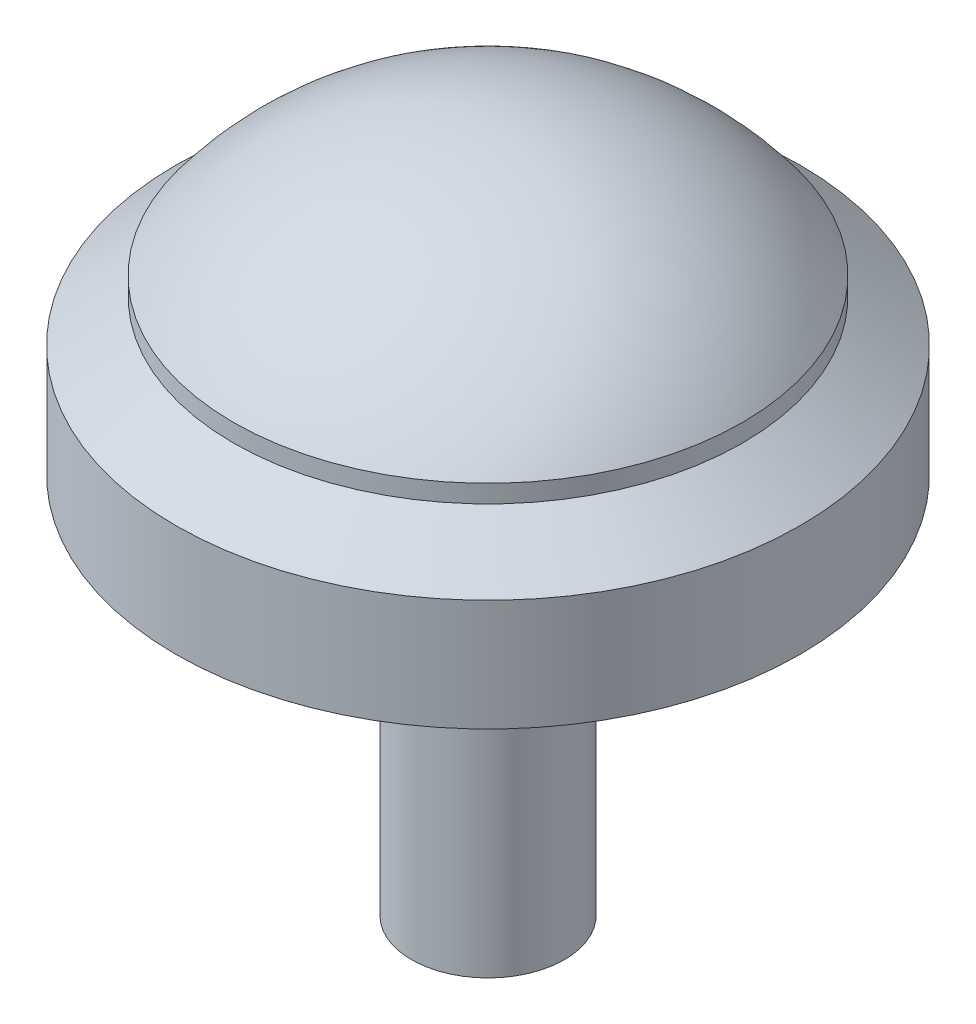
ISO-10303-21;
HEADER;
FILE_DESCRIPTION(('STEP AP214'),'2;1');
FILE_NAME('part.step','',(''),(''),'','','');
FILE_SCHEMA(('AUTOMOTIVE_DESIGN { 1 0 10303 214 1 1 1 1 }'));
ENDSEC;
DATA;
#1=APPLICATION_CONTEXT('core data for automotive mechanical design processes');
#2=APPLICATION_PROTOCOL_DEFINITION('international standard','automotive_design',2000,#1);
#3=PRODUCT_CONTEXT('',#1,'mechanical');
#4=PRODUCT('Part','Part','',(#3));
#5=PRODUCT_RELATED_PRODUCT_CATEGORY('part','',(#4));
#6=PRODUCT_DEFINITION_FORMATION('','',#4);
#7=PRODUCT_DEFINITION_CONTEXT('part definition',#1,'design');
#8=PRODUCT_DEFINITION('design','',#6,#7);
#9=PRODUCT_DEFINITION_SHAPE('','',#8);
#10=(LENGTH_UNIT() NAMED_UNIT(*) SI_UNIT(.MILLI.,.METRE.));
#11=(NAMED_UNIT(*) PLANE_ANGLE_UNIT() SI_UNIT($,.RADIAN.));
#12=(NAMED_UNIT(*) SI_UNIT($,.STERADIAN.) SOLID_ANGLE_UNIT());
#13=UNCERTAINTY_MEASURE_WITH_UNIT(LENGTH_MEASURE(1.E-05),#10,'distance_accuracy_value','');
#14=(GEOMETRIC_REPRESENTATION_CONTEXT(3) GLOBAL_UNCERTAINTY_ASSIGNED_CONTEXT((#13)) GLOBAL_UNIT_ASSIGNED_CONTEXT((#10,
#11,#12)) REPRESENTATION_CONTEXT('',''));
#15=CARTESIAN_POINT('',(0.,0.,0.));
#16=DIRECTION('',(0.,0.,1.));
#17=DIRECTION('',(1.,0.,0.));
#18=AXIS2_PLACEMENT_3D('',#15,#16,#17);
#19=CARTESIAN_POINT('',(0.,25.5,0.));
#20=DIRECTION('',(0.,-1.,0.));
#21=DIRECTION('',(0.,0.,-1.));
#22=AXIS2_PLACEMENT_3D('',#19,#20,#21);
#23=CYLINDRICAL_SURFACE('',#22,49.);
#24=CARTESIAN_POINT('',(0.,17.4999999999999,0.));
#25=DIRECTION('',(0.,1.,0.));
#26=DIRECTION('',(0.,0.,1.));
#27=AXIS2_PLACEMENT_3D('',#24,#25,#26);
#28=CIRCLE('',#27,49.);
#29=CARTESIAN_POINT('',(0.,17.4999999999999,49.));
#30=VERTEX_POINT('',#29);
#31=EDGE_CURVE('E62',#30,#30,#28,.F.);
#32=ORIENTED_EDGE('',*,*,#31,.T.);
#33=EDGE_LOOP('',(#32));
#34=FACE_BOUND('',#33,.T.);
#35=CARTESIAN_POINT('',(0.,0.,0.));
#36=DIRECTION('',(0.,1.,0.));
#37=DIRECTION('',(0.,0.,1.));
#38=AXIS2_PLACEMENT_3D('',#35,#36,#37);
#39=CIRCLE('',#38,49.);
#40=CARTESIAN_POINT('',(0.,0.,49.));
#41=VERTEX_POINT('',#40);
#42=EDGE_CURVE('E66',#41,#41,#39,.T.);
#43=ORIENTED_EDGE('',*,*,#42,.T.);
#44=EDGE_LOOP('',(#43));
#45=FACE_BOUND('',#44,.T.);
#46=ADVANCED_FACE('F47',(#34,#45),#23,.T.);
#47=CARTESIAN_POINT('',(0.,0.,0.));
#48=DIRECTION('',(0.,1.,0.));
#49=DIRECTION('',(0.,0.,1.));
#50=AXIS2_PLACEMENT_3D('',#47,#48,#49);
#51=PLANE('',#50);
#52=CARTESIAN_POINT('',(0.,0.,0.));
#53=DIRECTION('',(0.,-1.,0.));
#54=DIRECTION('',(0.,0.,-1.));
#55=AXIS2_PLACEMENT_3D('',#52,#53,#54);
#56=CIRCLE('',#55,12.);
#57=CARTESIAN_POINT('',(0.,0.,-12.));
#58=VERTEX_POINT('',#57);
#59=EDGE_CURVE('E11',#58,#58,#56,.T.);
#60=ORIENTED_EDGE('',*,*,#59,.F.);
#61=EDGE_LOOP('',(#60));
#62=FACE_BOUND('',#61,.T.);
#63=ORIENTED_EDGE('',*,*,#42,.F.);
#64=EDGE_LOOP('',(#63));
#65=FACE_BOUND('',#64,.T.);
#66=ADVANCED_FACE('F88',(#62,#65),#51,.F.);
#67=CARTESIAN_POINT('',(0.,27.,0.));
#68=DIRECTION('',(0.,-1.,0.));
#69=DIRECTION('',(0.,0.,-1.));
#70=AXIS2_PLACEMENT_3D('',#67,#68,#69);
#71=CYLINDRICAL_SURFACE('',#70,39.95);
#72=CARTESIAN_POINT('',(0.,24.1966477290077,0.));
#73=DIRECTION('',(0.,-1.,0.));
#74=DIRECTION('',(0.,0.,-1.));
#75=AXIS2_PLACEMENT_3D('',#72,#73,#74);
#76=CIRCLE('',#75,39.95);
#77=CARTESIAN_POINT('',(0.,24.1966477290077,-39.95));
#78=VERTEX_POINT('',#77);
#79=EDGE_CURVE('E52',#78,#78,#76,.F.);
#80=ORIENTED_EDGE('',*,*,#79,.T.);
#81=EDGE_LOOP('',(#80));
#82=FACE_BOUND('',#81,.T.);
#83=CARTESIAN_POINT('',(0.,27.,0.));
#84=DIRECTION('',(0.,1.,0.));
#85=DIRECTION('',(0.,0.,1.));
#86=AXIS2_PLACEMENT_3D('',#83,#84,#85);
#87=CIRCLE('',#86,39.95);
#88=CARTESIAN_POINT('',(0.,27.,39.95));
#89=VERTEX_POINT('',#88);
#90=EDGE_CURVE('E70',#89,#89,#87,.T.);
#91=ORIENTED_EDGE('',*,*,#90,.F.);
#92=EDGE_LOOP('',(#91));
#93=FACE_BOUND('',#92,.T.);
#94=ADVANCED_FACE('F85',(#82,#93),#71,.T.);
#95=CARTESIAN_POINT('',(0.,-2.90006249999999,0.));
#96=DIRECTION('',(0.,0.,1.));
#97=DIRECTION('',(1.,0.,0.));
#98=AXIS2_PLACEMENT_3D('',#95,#96,#97);
#99=SPHERICAL_SURFACE('',#98,49.9000625);
#100=CARTESIAN_POINT('',(0.,-2.90006249999999,0.));
#101=DIRECTION('',(0.,1.,0.));
#102=DIRECTION('',(0.,0.,1.));
#103=AXIS2_PLACEMENT_3D('',#100,#101,#102);
#104=SPHERICAL_SURFACE('',#103,49.9000625);
#105=ORIENTED_EDGE('',*,*,#90,.T.);
#106=EDGE_LOOP('',(#105));
#107=FACE_BOUND('',#106,.T.);
#108=ADVANCED_FACE('F82',(#107),#104,.T.);
#109=CARTESIAN_POINT('',(0.,25.5,0.));
#110=DIRECTION('',(0.,-1.,0.));
#111=DIRECTION('',(0.,0.,-1.));
#112=AXIS2_PLACEMENT_3D('',#109,#110,#111);
#113=CONICAL_SURFACE('',#112,38.1886204964333,0.933751149816971);
#114=ORIENTED_EDGE('',*,*,#31,.F.);
#115=EDGE_LOOP('',(#114));
#116=FACE_BOUND('',#115,.T.);
#117=ORIENTED_EDGE('',*,*,#79,.F.);
#118=EDGE_LOOP('',(#117));
#119=FACE_BOUND('',#118,.T.);
#120=ADVANCED_FACE('F50',(#116,#119),#113,.T.);
#121=CARTESIAN_POINT('',(0.,-60.,0.));
#122=DIRECTION('',(0.,1.,0.));
#123=DIRECTION('',(0.,0.,1.));
#124=AXIS2_PLACEMENT_3D('',#121,#122,#123);
#125=CYLINDRICAL_SURFACE('',#124,12.);
#126=CARTESIAN_POINT('',(0.,-60.,0.));
#127=DIRECTION('',(0.,-1.,0.));
#128=DIRECTION('',(0.,0.,-1.));
#129=AXIS2_PLACEMENT_3D('',#126,#127,#128);
#130=CIRCLE('',#129,12.);
#131=CARTESIAN_POINT('',(0.,-60.,-12.));
#132=VERTEX_POINT('',#131);
#133=EDGE_CURVE('E65',#132,#132,#130,.T.);
#134=ORIENTED_EDGE('',*,*,#133,.F.);
#135=EDGE_LOOP('',(#134));
#136=FACE_BOUND('',#135,.T.);
#137=ORIENTED_EDGE('',*,*,#59,.T.);
#138=EDGE_LOOP('',(#137));
#139=FACE_BOUND('',#138,.T.);
#140=ADVANCED_FACE('F81',(#136,#139),#125,.T.);
#141=CARTESIAN_POINT('',(0.,-60.,0.));
#142=DIRECTION('',(0.,-1.,0.));
#143=DIRECTION('',(0.,0.,-1.));
#144=AXIS2_PLACEMENT_3D('',#141,#142,#143);
#145=PLANE('',#144);
#146=ORIENTED_EDGE('',*,*,#133,.T.);
#147=EDGE_LOOP('',(#146));
#148=FACE_BOUND('',#147,.T.);
#149=ADVANCED_FACE('F105',(#148),#145,.T.);
#150=CLOSED_SHELL('',(#46,#66,#94,#108,#120,#140,#149));
#151=MANIFOLD_SOLID_BREP('B2',#150);
#152=ADVANCED_BREP_SHAPE_REPRESENTATION('',(#18,#151),#14);
#153=SHAPE_DEFINITION_REPRESENTATION(#9,#152);
ENDSEC;
END-ISO-10303-21;
